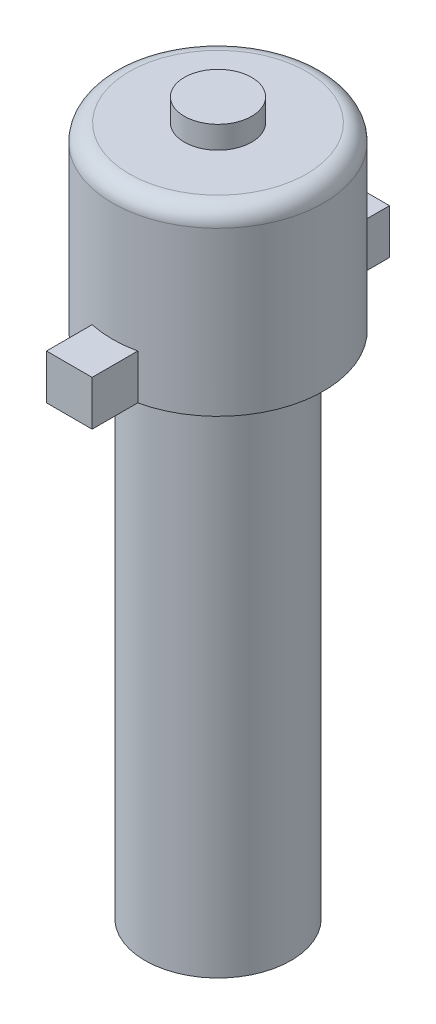
ISO-10303-21;
HEADER;
FILE_DESCRIPTION(('STEP AP214'),'2;1');
FILE_NAME('part.step','',(''),(''),'','','');
FILE_SCHEMA(('AUTOMOTIVE_DESIGN { 1 0 10303 214 1 1 1 1 }'));
ENDSEC;
DATA;
#1=APPLICATION_CONTEXT('core data for automotive mechanical design processes');
#2=APPLICATION_PROTOCOL_DEFINITION('international standard','automotive_design',2000,#1);
#3=PRODUCT_CONTEXT('',#1,'mechanical');
#4=PRODUCT('Part','Part','',(#3));
#5=PRODUCT_RELATED_PRODUCT_CATEGORY('part','',(#4));
#6=PRODUCT_DEFINITION_FORMATION('','',#4);
#7=PRODUCT_DEFINITION_CONTEXT('part definition',#1,'design');
#8=PRODUCT_DEFINITION('design','',#6,#7);
#9=PRODUCT_DEFINITION_SHAPE('','',#8);
#10=(LENGTH_UNIT() NAMED_UNIT(*) SI_UNIT(.MILLI.,.METRE.));
#11=(NAMED_UNIT(*) PLANE_ANGLE_UNIT() SI_UNIT($,.RADIAN.));
#12=(NAMED_UNIT(*) SI_UNIT($,.STERADIAN.) SOLID_ANGLE_UNIT());
#13=UNCERTAINTY_MEASURE_WITH_UNIT(LENGTH_MEASURE(1.E-05),#10,'distance_accuracy_value','');
#14=(GEOMETRIC_REPRESENTATION_CONTEXT(3) GLOBAL_UNCERTAINTY_ASSIGNED_CONTEXT((#13)) GLOBAL_UNIT_ASSIGNED_CONTEXT((#10,
#11,#12)) REPRESENTATION_CONTEXT('',''));
#15=CARTESIAN_POINT('',(0.,0.,0.));
#16=DIRECTION('',(0.,0.,1.));
#17=DIRECTION('',(1.,0.,0.));
#18=AXIS2_PLACEMENT_3D('',#15,#16,#17);
#19=CARTESIAN_POINT('',(0.,22.686,0.));
#20=DIRECTION('',(0.,-1.,0.));
#21=DIRECTION('',(0.,0.,-1.));
#22=AXIS2_PLACEMENT_3D('',#19,#20,#21);
#23=CYLINDRICAL_SURFACE('',#22,3.25);
#24=CARTESIAN_POINT('',(0.,22.686,0.));
#25=DIRECTION('',(0.,1.,0.));
#26=DIRECTION('',(0.,0.,1.));
#27=AXIS2_PLACEMENT_3D('',#24,#25,#26);
#28=CIRCLE('',#27,3.25);
#29=CARTESIAN_POINT('',(0.,22.686,3.25));
#30=VERTEX_POINT('',#29);
#31=EDGE_CURVE('E228',#30,#30,#28,.T.);
#32=ORIENTED_EDGE('',*,*,#31,.F.);
#33=EDGE_LOOP('',(#32));
#34=FACE_BOUND('',#33,.T.);
#35=CARTESIAN_POINT('',(0.,0.,0.));
#36=DIRECTION('',(0.,1.,0.));
#37=DIRECTION('',(0.,0.,1.));
#38=AXIS2_PLACEMENT_3D('',#35,#36,#37);
#39=CIRCLE('',#38,3.25);
#40=CARTESIAN_POINT('',(0.,0.,3.25));
#41=VERTEX_POINT('',#40);
#42=EDGE_CURVE('E227',#41,#41,#39,.T.);
#43=ORIENTED_EDGE('',*,*,#42,.T.);
#44=EDGE_LOOP('',(#43));
#45=FACE_BOUND('',#44,.T.);
#46=ADVANCED_FACE('F63',(#34,#45),#23,.T.);
#47=CARTESIAN_POINT('',(0.,0.,0.));
#48=DIRECTION('',(0.,1.,0.));
#49=DIRECTION('',(0.,0.,1.));
#50=AXIS2_PLACEMENT_3D('',#47,#48,#49);
#51=PLANE('',#50);
#52=ORIENTED_EDGE('',*,*,#42,.F.);
#53=EDGE_LOOP('',(#52));
#54=FACE_BOUND('',#53,.T.);
#55=ADVANCED_FACE('F257',(#54),#51,.F.);
#56=CARTESIAN_POINT('',(0.,30.686,0.));
#57=DIRECTION('',(0.,-1.,0.));
#58=DIRECTION('',(0.,0.,-1.));
#59=AXIS2_PLACEMENT_3D('',#56,#57,#58);
#60=CYLINDRICAL_SURFACE('',#59,4.7);
#61=CARTESIAN_POINT('',(0.,22.686,0.));
#62=DIRECTION('',(0.,1.,0.));
#63=DIRECTION('',(0.,0.,1.));
#64=AXIS2_PLACEMENT_3D('',#61,#62,#63);
#65=CIRCLE('',#64,4.7);
#66=CARTESIAN_POINT('',(-1.016,22.686,-4.58887175676113));
#67=VERTEX_POINT('',#66);
#68=CARTESIAN_POINT('',(-1.016,22.686,4.58887175676113));
#69=VERTEX_POINT('',#68);
#70=EDGE_CURVE('E220',#67,#69,#65,.T.);
#71=ORIENTED_EDGE('',*,*,#70,.T.);
#72=DIRECTION('',(0.,-1.,0.));
#73=VECTOR('',#72,1.);
#74=CARTESIAN_POINT('',(-1.016,24.686,4.58887175676113));
#75=LINE('',#74,#73);
#76=CARTESIAN_POINT('',(-1.016,24.686,4.58887175676113));
#77=VERTEX_POINT('',#76);
#78=EDGE_CURVE('E79',#77,#69,#75,.T.);
#79=ORIENTED_EDGE('',*,*,#78,.F.);
#80=CARTESIAN_POINT('',(0.,24.686,0.));
#81=DIRECTION('',(0.,1.,0.));
#82=DIRECTION('',(0.,0.,-1.));
#83=AXIS2_PLACEMENT_3D('',#80,#81,#82);
#84=CIRCLE('',#83,4.7);
#85=CARTESIAN_POINT('',(1.016,24.686,4.58887175676113));
#86=VERTEX_POINT('',#85);
#87=EDGE_CURVE('E83',#77,#86,#84,.T.);
#88=ORIENTED_EDGE('',*,*,#87,.T.);
#89=DIRECTION('',(0.,-1.,0.));
#90=VECTOR('',#89,1.);
#91=CARTESIAN_POINT('',(1.016,24.686,4.58887175676113));
#92=LINE('',#91,#90);
#93=CARTESIAN_POINT('',(1.016,22.686,4.58887175676113));
#94=VERTEX_POINT('',#93);
#95=EDGE_CURVE('E141',#86,#94,#92,.T.);
#96=ORIENTED_EDGE('',*,*,#95,.T.);
#97=CARTESIAN_POINT('',(1.016,22.686,-4.58887175676113));
#98=VERTEX_POINT('',#97);
#99=EDGE_CURVE('E224',#94,#98,#65,.T.);
#100=ORIENTED_EDGE('',*,*,#99,.T.);
#101=DIRECTION('',(0.,-1.,0.));
#102=VECTOR('',#101,1.);
#103=CARTESIAN_POINT('',(1.016,24.686,-4.58887175676113));
#104=LINE('',#103,#102);
#105=CARTESIAN_POINT('',(1.016,24.686,-4.58887175676113));
#106=VERTEX_POINT('',#105);
#107=EDGE_CURVE('E187',#106,#98,#104,.T.);
#108=ORIENTED_EDGE('',*,*,#107,.F.);
#109=CARTESIAN_POINT('',(0.,24.686,0.));
#110=DIRECTION('',(0.,1.,0.));
#111=DIRECTION('',(0.,0.,1.));
#112=AXIS2_PLACEMENT_3D('',#109,#110,#111);
#113=CIRCLE('',#112,4.7);
#114=CARTESIAN_POINT('',(-1.016,24.686,-4.58887175676113));
#115=VERTEX_POINT('',#114);
#116=EDGE_CURVE('E196',#106,#115,#113,.T.);
#117=ORIENTED_EDGE('',*,*,#116,.T.);
#118=DIRECTION('',(0.,-1.,0.));
#119=VECTOR('',#118,1.);
#120=CARTESIAN_POINT('',(-1.016,24.686,-4.58887175676113));
#121=LINE('',#120,#119);
#122=EDGE_CURVE('E176',#115,#67,#121,.T.);
#123=ORIENTED_EDGE('',*,*,#122,.T.);
#124=EDGE_LOOP('',(#71,#79,#88,#96,#100,#108,#117,#123));
#125=FACE_BOUND('',#124,.T.);
#126=CARTESIAN_POINT('',(0.,29.936,0.));
#127=DIRECTION('',(0.,1.,0.));
#128=DIRECTION('',(0.,0.,1.));
#129=AXIS2_PLACEMENT_3D('',#126,#127,#128);
#130=CIRCLE('',#129,4.7);
#131=CARTESIAN_POINT('',(0.,29.936,4.7));
#132=VERTEX_POINT('',#131);
#133=EDGE_CURVE('E12',#132,#132,#130,.F.);
#134=ORIENTED_EDGE('',*,*,#133,.T.);
#135=EDGE_LOOP('',(#134));
#136=FACE_BOUND('',#135,.T.);
#137=ADVANCED_FACE('F261',(#125,#136),#60,.T.);
#138=CARTESIAN_POINT('',(0.,30.686,0.));
#139=DIRECTION('',(0.,1.,0.));
#140=DIRECTION('',(0.,0.,1.));
#141=AXIS2_PLACEMENT_3D('',#138,#139,#140);
#142=PLANE('',#141);
#143=CARTESIAN_POINT('',(0.,30.686,0.));
#144=DIRECTION('',(0.,1.,0.));
#145=DIRECTION('',(0.,0.,1.));
#146=AXIS2_PLACEMENT_3D('',#143,#144,#145);
#147=CIRCLE('',#146,1.5);
#148=CARTESIAN_POINT('',(0.,30.686,1.5));
#149=VERTEX_POINT('',#148);
#150=EDGE_CURVE('E171',#149,#149,#147,.T.);
#151=ORIENTED_EDGE('',*,*,#150,.F.);
#152=EDGE_LOOP('',(#151));
#153=FACE_BOUND('',#152,.T.);
#154=CARTESIAN_POINT('',(0.,30.686,0.));
#155=DIRECTION('',(0.,1.,0.));
#156=DIRECTION('',(0.,0.,1.));
#157=AXIS2_PLACEMENT_3D('',#154,#155,#156);
#158=CIRCLE('',#157,3.95);
#159=CARTESIAN_POINT('',(0.,30.686,3.95));
#160=VERTEX_POINT('',#159);
#161=EDGE_CURVE('E72',#160,#160,#158,.T.);
#162=ORIENTED_EDGE('',*,*,#161,.T.);
#163=EDGE_LOOP('',(#162));
#164=FACE_BOUND('',#163,.T.);
#165=ADVANCED_FACE('F238',(#153,#164),#142,.T.);
#166=CARTESIAN_POINT('',(0.,22.686,0.));
#167=DIRECTION('',(0.,1.,0.));
#168=DIRECTION('',(0.,0.,1.));
#169=AXIS2_PLACEMENT_3D('',#166,#167,#168);
#170=PLANE('',#169);
#171=ORIENTED_EDGE('',*,*,#31,.T.);
#172=EDGE_LOOP('',(#171));
#173=FACE_BOUND('',#172,.T.);
#174=ORIENTED_EDGE('',*,*,#99,.F.);
#175=DIRECTION('',(0.,0.,1.));
#176=VECTOR('',#175,1.);
#177=CARTESIAN_POINT('',(1.016,22.686,6.62087175676113));
#178=LINE('',#177,#176);
#179=CARTESIAN_POINT('',(1.016,22.686,6.62087175676113));
#180=VERTEX_POINT('',#179);
#181=EDGE_CURVE('E160',#94,#180,#178,.T.);
#182=ORIENTED_EDGE('',*,*,#181,.T.);
#183=DIRECTION('',(-1.,0.,0.));
#184=VECTOR('',#183,1.);
#185=CARTESIAN_POINT('',(-1.016,22.686,6.62087175676113));
#186=LINE('',#185,#184);
#187=CARTESIAN_POINT('',(-1.016,22.686,6.62087175676113));
#188=VERTEX_POINT('',#187);
#189=EDGE_CURVE('E134',#180,#188,#186,.T.);
#190=ORIENTED_EDGE('',*,*,#189,.T.);
#191=DIRECTION('',(0.,0.,-1.));
#192=VECTOR('',#191,1.);
#193=CARTESIAN_POINT('',(-1.016,22.686,4.58887175676113));
#194=LINE('',#193,#192);
#195=EDGE_CURVE('E155',#188,#69,#194,.T.);
#196=ORIENTED_EDGE('',*,*,#195,.T.);
#197=ORIENTED_EDGE('',*,*,#70,.F.);
#198=DIRECTION('',(0.,0.,-1.));
#199=VECTOR('',#198,1.);
#200=CARTESIAN_POINT('',(-1.016,22.686,-4.58887175676113));
#201=LINE('',#200,#199);
#202=CARTESIAN_POINT('',(-1.016,22.686,-6.62087175676113));
#203=VERTEX_POINT('',#202);
#204=EDGE_CURVE('E163',#67,#203,#201,.T.);
#205=ORIENTED_EDGE('',*,*,#204,.T.);
#206=DIRECTION('',(1.,0.,0.));
#207=VECTOR('',#206,1.);
#208=CARTESIAN_POINT('',(-1.016,22.686,-6.62087175676113));
#209=LINE('',#208,#207);
#210=CARTESIAN_POINT('',(1.016,22.686,-6.62087175676113));
#211=VERTEX_POINT('',#210);
#212=EDGE_CURVE('E195',#203,#211,#209,.T.);
#213=ORIENTED_EDGE('',*,*,#212,.T.);
#214=DIRECTION('',(0.,0.,1.));
#215=VECTOR('',#214,1.);
#216=CARTESIAN_POINT('',(1.016,22.686,-6.62087175676113));
#217=LINE('',#216,#215);
#218=EDGE_CURVE('E191',#211,#98,#217,.T.);
#219=ORIENTED_EDGE('',*,*,#218,.T.);
#220=EDGE_LOOP('',(#174,#182,#190,#196,#197,#205,#213,#219));
#221=FACE_BOUND('',#220,.T.);
#222=ADVANCED_FACE('F242',(#173,#221),#170,.F.);
#223=CARTESIAN_POINT('',(0.,29.936,0.));
#224=DIRECTION('',(0.,1.,0.));
#225=DIRECTION('',(0.,0.,1.));
#226=AXIS2_PLACEMENT_3D('',#223,#224,#225);
#227=TOROIDAL_SURFACE('',#226,3.95,0.75);
#228=ORIENTED_EDGE('',*,*,#133,.F.);
#229=EDGE_LOOP('',(#228));
#230=FACE_BOUND('',#229,.T.);
#231=ORIENTED_EDGE('',*,*,#161,.F.);
#232=EDGE_LOOP('',(#231));
#233=FACE_BOUND('',#232,.T.);
#234=ADVANCED_FACE('F65',(#230,#233),#227,.T.);
#235=CARTESIAN_POINT('',(0.,31.686,0.));
#236=DIRECTION('',(0.,-1.,0.));
#237=DIRECTION('',(0.,0.,-1.));
#238=AXIS2_PLACEMENT_3D('',#235,#236,#237);
#239=CYLINDRICAL_SURFACE('',#238,1.5);
#240=CARTESIAN_POINT('',(0.,31.686,0.));
#241=DIRECTION('',(0.,1.,0.));
#242=DIRECTION('',(0.,0.,1.));
#243=AXIS2_PLACEMENT_3D('',#240,#241,#242);
#244=CIRCLE('',#243,1.5);
#245=CARTESIAN_POINT('',(0.,31.686,1.5));
#246=VERTEX_POINT('',#245);
#247=EDGE_CURVE('E216',#246,#246,#244,.T.);
#248=ORIENTED_EDGE('',*,*,#247,.F.);
#249=EDGE_LOOP('',(#248));
#250=FACE_BOUND('',#249,.T.);
#251=ORIENTED_EDGE('',*,*,#150,.T.);
#252=EDGE_LOOP('',(#251));
#253=FACE_BOUND('',#252,.T.);
#254=ADVANCED_FACE('F241',(#250,#253),#239,.T.);
#255=CARTESIAN_POINT('',(0.,31.686,0.));
#256=DIRECTION('',(0.,1.,0.));
#257=DIRECTION('',(0.,0.,1.));
#258=AXIS2_PLACEMENT_3D('',#255,#256,#257);
#259=PLANE('',#258);
#260=ORIENTED_EDGE('',*,*,#247,.T.);
#261=EDGE_LOOP('',(#260));
#262=FACE_BOUND('',#261,.T.);
#263=ADVANCED_FACE('F249',(#262),#259,.T.);
#264=CARTESIAN_POINT('',(1.016,24.686,-6.62087175676113));
#265=DIRECTION('',(1.,0.,0.));
#266=DIRECTION('',(0.,0.,-1.));
#267=AXIS2_PLACEMENT_3D('',#264,#265,#266);
#268=PLANE('',#267);
#269=ORIENTED_EDGE('',*,*,#218,.F.);
#270=DIRECTION('',(0.,-1.,0.));
#271=VECTOR('',#270,1.);
#272=CARTESIAN_POINT('',(1.016,24.686,-6.62087175676113));
#273=LINE('',#272,#271);
#274=CARTESIAN_POINT('',(1.016,24.686,-6.62087175676113));
#275=VERTEX_POINT('',#274);
#276=EDGE_CURVE('E184',#275,#211,#273,.T.);
#277=ORIENTED_EDGE('',*,*,#276,.F.);
#278=DIRECTION('',(0.,0.,1.));
#279=VECTOR('',#278,1.);
#280=CARTESIAN_POINT('',(1.016,24.686,-6.62087175676113));
#281=LINE('',#280,#279);
#282=EDGE_CURVE('E180',#275,#106,#281,.T.);
#283=ORIENTED_EDGE('',*,*,#282,.T.);
#284=ORIENTED_EDGE('',*,*,#107,.T.);
#285=EDGE_LOOP('',(#269,#277,#283,#284));
#286=FACE_BOUND('',#285,.T.);
#287=ADVANCED_FACE('F273',(#286),#268,.T.);
#288=CARTESIAN_POINT('',(-1.016,24.686,-6.62087175676113));
#289=DIRECTION('',(0.,0.,-1.));
#290=DIRECTION('',(-1.,0.,0.));
#291=AXIS2_PLACEMENT_3D('',#288,#289,#290);
#292=PLANE('',#291);
#293=ORIENTED_EDGE('',*,*,#212,.F.);
#294=DIRECTION('',(0.,-1.,0.));
#295=VECTOR('',#294,1.);
#296=CARTESIAN_POINT('',(-1.016,24.686,-6.62087175676113));
#297=LINE('',#296,#295);
#298=CARTESIAN_POINT('',(-1.016,24.686,-6.62087175676113));
#299=VERTEX_POINT('',#298);
#300=EDGE_CURVE('E181',#299,#203,#297,.T.);
#301=ORIENTED_EDGE('',*,*,#300,.F.);
#302=DIRECTION('',(1.,0.,0.));
#303=VECTOR('',#302,1.);
#304=CARTESIAN_POINT('',(-1.016,24.686,-6.62087175676113));
#305=LINE('',#304,#303);
#306=EDGE_CURVE('E206',#299,#275,#305,.T.);
#307=ORIENTED_EDGE('',*,*,#306,.T.);
#308=ORIENTED_EDGE('',*,*,#276,.T.);
#309=EDGE_LOOP('',(#293,#301,#307,#308));
#310=FACE_BOUND('',#309,.T.);
#311=ADVANCED_FACE('F283',(#310),#292,.T.);
#312=CARTESIAN_POINT('',(-1.016,24.686,-4.58887175676113));
#313=DIRECTION('',(-1.,0.,0.));
#314=DIRECTION('',(0.,0.,1.));
#315=AXIS2_PLACEMENT_3D('',#312,#313,#314);
#316=PLANE('',#315);
#317=ORIENTED_EDGE('',*,*,#204,.F.);
#318=ORIENTED_EDGE('',*,*,#122,.F.);
#319=DIRECTION('',(0.,0.,-1.));
#320=VECTOR('',#319,1.);
#321=CARTESIAN_POINT('',(-1.016,24.686,-4.58887175676113));
#322=LINE('',#321,#320);
#323=EDGE_CURVE('E210',#115,#299,#322,.T.);
#324=ORIENTED_EDGE('',*,*,#323,.T.);
#325=ORIENTED_EDGE('',*,*,#300,.T.);
#326=EDGE_LOOP('',(#317,#318,#324,#325));
#327=FACE_BOUND('',#326,.T.);
#328=ADVANCED_FACE('F279',(#327),#316,.T.);
#329=CARTESIAN_POINT('',(0.,24.686,0.));
#330=DIRECTION('',(0.,1.,0.));
#331=DIRECTION('',(0.,0.,1.));
#332=AXIS2_PLACEMENT_3D('',#329,#330,#331);
#333=PLANE('',#332);
#334=ORIENTED_EDGE('',*,*,#116,.F.);
#335=ORIENTED_EDGE('',*,*,#282,.F.);
#336=ORIENTED_EDGE('',*,*,#306,.F.);
#337=ORIENTED_EDGE('',*,*,#323,.F.);
#338=EDGE_LOOP('',(#334,#335,#336,#337));
#339=FACE_BOUND('',#338,.T.);
#340=ADVANCED_FACE('F275',(#339),#333,.T.);
#341=CARTESIAN_POINT('',(-1.016,24.686,4.58887175676113));
#342=DIRECTION('',(-1.,0.,0.));
#343=DIRECTION('',(0.,0.,1.));
#344=AXIS2_PLACEMENT_3D('',#341,#342,#343);
#345=PLANE('',#344);
#346=ORIENTED_EDGE('',*,*,#195,.F.);
#347=DIRECTION('',(0.,-1.,0.));
#348=VECTOR('',#347,1.);
#349=CARTESIAN_POINT('',(-1.016,24.686,6.62087175676113));
#350=LINE('',#349,#348);
#351=CARTESIAN_POINT('',(-1.016,24.686,6.62087175676113));
#352=VERTEX_POINT('',#351);
#353=EDGE_CURVE('E140',#352,#188,#350,.T.);
#354=ORIENTED_EDGE('',*,*,#353,.F.);
#355=DIRECTION('',(0.,0.,-1.));
#356=VECTOR('',#355,1.);
#357=CARTESIAN_POINT('',(-1.016,24.686,4.58887175676113));
#358=LINE('',#357,#356);
#359=EDGE_CURVE('E148',#352,#77,#358,.T.);
#360=ORIENTED_EDGE('',*,*,#359,.T.);
#361=ORIENTED_EDGE('',*,*,#78,.T.);
#362=EDGE_LOOP('',(#346,#354,#360,#361));
#363=FACE_BOUND('',#362,.T.);
#364=ADVANCED_FACE('F278',(#363),#345,.T.);
#365=CARTESIAN_POINT('',(-1.016,24.686,6.62087175676113));
#366=DIRECTION('',(0.,0.,1.));
#367=DIRECTION('',(1.,0.,0.));
#368=AXIS2_PLACEMENT_3D('',#365,#366,#367);
#369=PLANE('',#368);
#370=ORIENTED_EDGE('',*,*,#189,.F.);
#371=DIRECTION('',(0.,-1.,0.));
#372=VECTOR('',#371,1.);
#373=CARTESIAN_POINT('',(1.016,24.686,6.62087175676113));
#374=LINE('',#373,#372);
#375=CARTESIAN_POINT('',(1.016,24.686,6.62087175676113));
#376=VERTEX_POINT('',#375);
#377=EDGE_CURVE('E128',#376,#180,#374,.T.);
#378=ORIENTED_EDGE('',*,*,#377,.F.);
#379=DIRECTION('',(-1.,0.,0.));
#380=VECTOR('',#379,1.);
#381=CARTESIAN_POINT('',(-1.016,24.686,6.62087175676113));
#382=LINE('',#381,#380);
#383=EDGE_CURVE('E131',#376,#352,#382,.T.);
#384=ORIENTED_EDGE('',*,*,#383,.T.);
#385=ORIENTED_EDGE('',*,*,#353,.T.);
#386=EDGE_LOOP('',(#370,#378,#384,#385));
#387=FACE_BOUND('',#386,.T.);
#388=ADVANCED_FACE('F130',(#387),#369,.T.);
#389=CARTESIAN_POINT('',(1.016,24.686,6.62087175676113));
#390=DIRECTION('',(1.,0.,0.));
#391=DIRECTION('',(0.,0.,-1.));
#392=AXIS2_PLACEMENT_3D('',#389,#390,#391);
#393=PLANE('',#392);
#394=ORIENTED_EDGE('',*,*,#181,.F.);
#395=ORIENTED_EDGE('',*,*,#95,.F.);
#396=DIRECTION('',(0.,0.,1.));
#397=VECTOR('',#396,1.);
#398=CARTESIAN_POINT('',(1.016,24.686,6.62087175676113));
#399=LINE('',#398,#397);
#400=EDGE_CURVE('E146',#86,#376,#399,.T.);
#401=ORIENTED_EDGE('',*,*,#400,.T.);
#402=ORIENTED_EDGE('',*,*,#377,.T.);
#403=EDGE_LOOP('',(#394,#395,#401,#402));
#404=FACE_BOUND('',#403,.T.);
#405=ADVANCED_FACE('F151',(#404),#393,.T.);
#406=CARTESIAN_POINT('',(0.,24.686,0.));
#407=DIRECTION('',(0.,-1.,0.));
#408=DIRECTION('',(0.,0.,-1.));
#409=AXIS2_PLACEMENT_3D('',#406,#407,#408);
#410=PLANE('',#409);
#411=ORIENTED_EDGE('',*,*,#87,.F.);
#412=ORIENTED_EDGE('',*,*,#359,.F.);
#413=ORIENTED_EDGE('',*,*,#383,.F.);
#414=ORIENTED_EDGE('',*,*,#400,.F.);
#415=EDGE_LOOP('',(#411,#412,#413,#414));
#416=FACE_BOUND('',#415,.T.);
#417=ADVANCED_FACE('F145',(#416),#410,.F.);
#418=CLOSED_SHELL('',(#46,#55,#137,#165,#222,#234,#254,#263,#287,#311,#328,#340,#364,#388,#405,#417));
#419=MANIFOLD_SOLID_BREP('B2',#418);
#420=ADVANCED_BREP_SHAPE_REPRESENTATION('',(#18,#419),#14);
#421=SHAPE_DEFINITION_REPRESENTATION(#9,#420);
ENDSEC;
END-ISO-10303-21;
